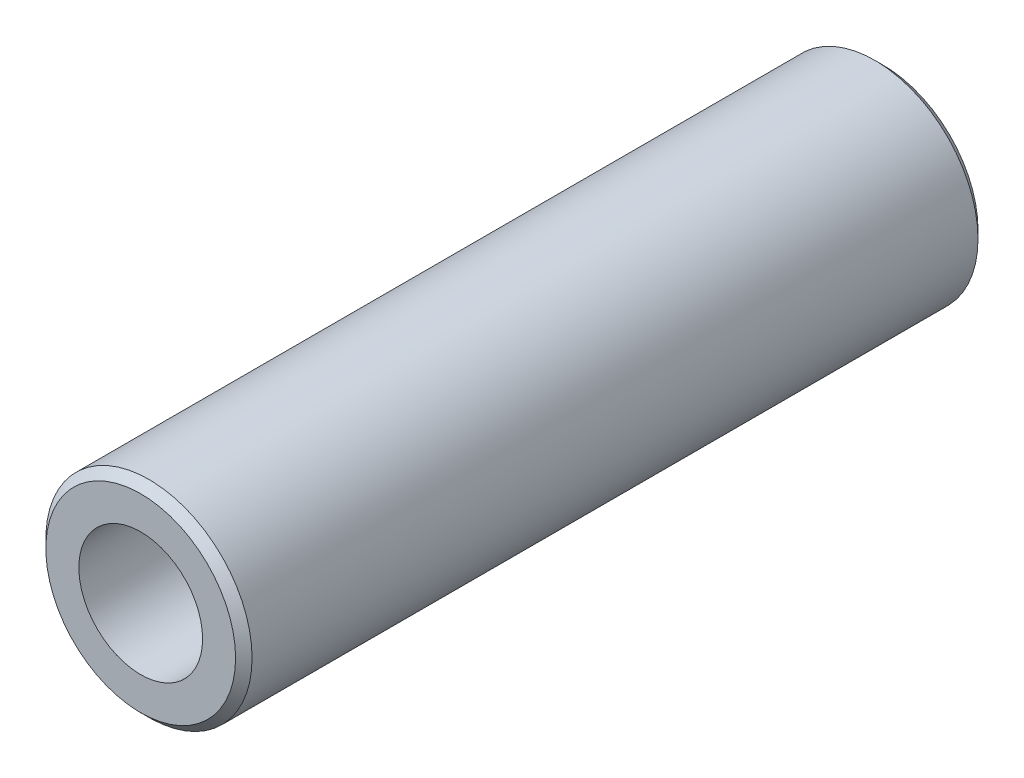
ISO-10303-21;
HEADER;
FILE_DESCRIPTION(('STEP AP214'),'2;1');
FILE_NAME('part.step','',(''),(''),'','','');
FILE_SCHEMA(('AUTOMOTIVE_DESIGN { 1 0 10303 214 1 1 1 1 }'));
ENDSEC;
DATA;
#1=APPLICATION_CONTEXT('core data for automotive mechanical design processes');
#2=APPLICATION_PROTOCOL_DEFINITION('international standard','automotive_design',2000,#1);
#3=PRODUCT_CONTEXT('',#1,'mechanical');
#4=PRODUCT('Part','Part','',(#3));
#5=PRODUCT_RELATED_PRODUCT_CATEGORY('part','',(#4));
#6=PRODUCT_DEFINITION_FORMATION('','',#4);
#7=PRODUCT_DEFINITION_CONTEXT('part definition',#1,'design');
#8=PRODUCT_DEFINITION('design','',#6,#7);
#9=PRODUCT_DEFINITION_SHAPE('','',#8);
#10=(LENGTH_UNIT() NAMED_UNIT(*) SI_UNIT(.MILLI.,.METRE.));
#11=(NAMED_UNIT(*) PLANE_ANGLE_UNIT() SI_UNIT($,.RADIAN.));
#12=(NAMED_UNIT(*) SI_UNIT($,.STERADIAN.) SOLID_ANGLE_UNIT());
#13=UNCERTAINTY_MEASURE_WITH_UNIT(LENGTH_MEASURE(1.E-05),#10,'distance_accuracy_value','');
#14=(GEOMETRIC_REPRESENTATION_CONTEXT(3) GLOBAL_UNCERTAINTY_ASSIGNED_CONTEXT((#13)) GLOBAL_UNIT_ASSIGNED_CONTEXT((#10,
#11,#12)) REPRESENTATION_CONTEXT('',''));
#15=CARTESIAN_POINT('',(0.,0.,0.));
#16=DIRECTION('',(0.,0.,1.));
#17=DIRECTION('',(1.,0.,0.));
#18=AXIS2_PLACEMENT_3D('',#15,#16,#17);
#19=CARTESIAN_POINT('',(0.,0.,22.5));
#20=DIRECTION('',(0.,0.,1.));
#21=DIRECTION('',(1.,0.,0.));
#22=AXIS2_PLACEMENT_3D('',#19,#20,#21);
#23=PLANE('',#22);
#24=CARTESIAN_POINT('',(0.,0.,22.5));
#25=DIRECTION('',(0.,0.,1.));
#26=DIRECTION('',(1.,0.,0.));
#27=AXIS2_PLACEMENT_3D('',#24,#25,#26);
#28=CIRCLE('',#27,5.75000000000002);
#29=CARTESIAN_POINT('',(5.75000000000002,0.,22.5));
#30=VERTEX_POINT('',#29);
#31=EDGE_CURVE('E11',#30,#30,#28,.T.);
#32=ORIENTED_EDGE('',*,*,#31,.T.);
#33=EDGE_LOOP('',(#32));
#34=FACE_BOUND('',#33,.T.);
#35=CARTESIAN_POINT('',(0.,0.,22.5));
#36=DIRECTION('',(0.,0.,1.));
#37=DIRECTION('',(1.,0.,0.));
#38=AXIS2_PLACEMENT_3D('',#35,#36,#37);
#39=CIRCLE('',#38,3.75);
#40=CARTESIAN_POINT('',(3.75,0.,22.5));
#41=VERTEX_POINT('',#40);
#42=EDGE_CURVE('E74',#41,#41,#39,.T.);
#43=ORIENTED_EDGE('',*,*,#42,.F.);
#44=EDGE_LOOP('',(#43));
#45=FACE_BOUND('',#44,.T.);
#46=ADVANCED_FACE('F49',(#34,#45),#23,.T.);
#47=CARTESIAN_POINT('',(0.,0.,-22.5));
#48=DIRECTION('',(0.,0.,1.));
#49=DIRECTION('',(1.,0.,0.));
#50=AXIS2_PLACEMENT_3D('',#47,#48,#49);
#51=PLANE('',#50);
#52=CARTESIAN_POINT('',(0.,0.,-22.5));
#53=DIRECTION('',(0.,0.,1.));
#54=DIRECTION('',(1.,0.,0.));
#55=AXIS2_PLACEMENT_3D('',#52,#53,#54);
#56=CIRCLE('',#55,5.74999999999996);
#57=CARTESIAN_POINT('',(5.74999999999996,0.,-22.5));
#58=VERTEX_POINT('',#57);
#59=EDGE_CURVE('E58',#58,#58,#56,.F.);
#60=ORIENTED_EDGE('',*,*,#59,.T.);
#61=EDGE_LOOP('',(#60));
#62=FACE_BOUND('',#61,.T.);
#63=CARTESIAN_POINT('',(0.,0.,-22.5));
#64=DIRECTION('',(0.,0.,1.));
#65=DIRECTION('',(1.,0.,0.));
#66=AXIS2_PLACEMENT_3D('',#63,#64,#65);
#67=CIRCLE('',#66,3.75);
#68=CARTESIAN_POINT('',(3.75,0.,-22.5));
#69=VERTEX_POINT('',#68);
#70=EDGE_CURVE('E75',#69,#69,#67,.T.);
#71=ORIENTED_EDGE('',*,*,#70,.T.);
#72=EDGE_LOOP('',(#71));
#73=FACE_BOUND('',#72,.T.);
#74=ADVANCED_FACE('F87',(#62,#73),#51,.F.);
#75=CARTESIAN_POINT('',(0.,0.,22.5));
#76=DIRECTION('',(0.,0.,-1.));
#77=DIRECTION('',(-1.,0.,0.));
#78=AXIS2_PLACEMENT_3D('',#75,#76,#77);
#79=CYLINDRICAL_SURFACE('',#78,6.25);
#80=CARTESIAN_POINT('',(0.,0.,-22.));
#81=DIRECTION('',(0.,0.,1.));
#82=DIRECTION('',(1.,0.,0.));
#83=AXIS2_PLACEMENT_3D('',#80,#81,#82);
#84=CIRCLE('',#83,6.25);
#85=CARTESIAN_POINT('',(6.25,0.,-22.));
#86=VERTEX_POINT('',#85);
#87=EDGE_CURVE('E63',#86,#86,#84,.T.);
#88=ORIENTED_EDGE('',*,*,#87,.T.);
#89=EDGE_LOOP('',(#88));
#90=FACE_BOUND('',#89,.T.);
#91=CARTESIAN_POINT('',(0.,0.,22.));
#92=DIRECTION('',(0.,0.,1.));
#93=DIRECTION('',(1.,0.,0.));
#94=AXIS2_PLACEMENT_3D('',#91,#92,#93);
#95=CIRCLE('',#94,6.25);
#96=CARTESIAN_POINT('',(6.25,0.,22.));
#97=VERTEX_POINT('',#96);
#98=EDGE_CURVE('E68',#97,#97,#95,.F.);
#99=ORIENTED_EDGE('',*,*,#98,.T.);
#100=EDGE_LOOP('',(#99));
#101=FACE_BOUND('',#100,.T.);
#102=ADVANCED_FACE('F92',(#90,#101),#79,.T.);
#103=CARTESIAN_POINT('',(0.,0.,22.5));
#104=DIRECTION('',(0.,0.,-1.));
#105=DIRECTION('',(-1.,0.,0.));
#106=AXIS2_PLACEMENT_3D('',#103,#104,#105);
#107=CYLINDRICAL_SURFACE('',#106,3.75);
#108=ORIENTED_EDGE('',*,*,#42,.T.);
#109=EDGE_LOOP('',(#108));
#110=FACE_BOUND('',#109,.T.);
#111=ORIENTED_EDGE('',*,*,#70,.F.);
#112=EDGE_LOOP('',(#111));
#113=FACE_BOUND('',#112,.T.);
#114=ADVANCED_FACE('F83',(#110,#113),#107,.F.);
#115=CARTESIAN_POINT('',(0.,0.,-22.));
#116=DIRECTION('',(0.,0.,1.));
#117=DIRECTION('',(1.,0.,0.));
#118=AXIS2_PLACEMENT_3D('',#115,#116,#117);
#119=CONICAL_SURFACE('',#118,6.25,0.785398163397449);
#120=ORIENTED_EDGE('',*,*,#59,.F.);
#121=EDGE_LOOP('',(#120));
#122=FACE_BOUND('',#121,.T.);
#123=ORIENTED_EDGE('',*,*,#87,.F.);
#124=EDGE_LOOP('',(#123));
#125=FACE_BOUND('',#124,.T.);
#126=ADVANCED_FACE('F99',(#122,#125),#119,.T.);
#127=CARTESIAN_POINT('',(0.,0.,22.5));
#128=DIRECTION('',(0.,0.,-1.));
#129=DIRECTION('',(-1.,0.,0.));
#130=AXIS2_PLACEMENT_3D('',#127,#128,#129);
#131=CONICAL_SURFACE('',#130,5.75000000000002,0.785398163397446);
#132=ORIENTED_EDGE('',*,*,#98,.F.);
#133=EDGE_LOOP('',(#132));
#134=FACE_BOUND('',#133,.T.);
#135=ORIENTED_EDGE('',*,*,#31,.F.);
#136=EDGE_LOOP('',(#135));
#137=FACE_BOUND('',#136,.T.);
#138=ADVANCED_FACE('F52',(#134,#137),#131,.T.);
#139=CLOSED_SHELL('',(#46,#74,#102,#114,#126,#138));
#140=MANIFOLD_SOLID_BREP('B2',#139);
#141=ADVANCED_BREP_SHAPE_REPRESENTATION('',(#18,#140),#14);
#142=SHAPE_DEFINITION_REPRESENTATION(#9,#141);
ENDSEC;
END-ISO-10303-21;
